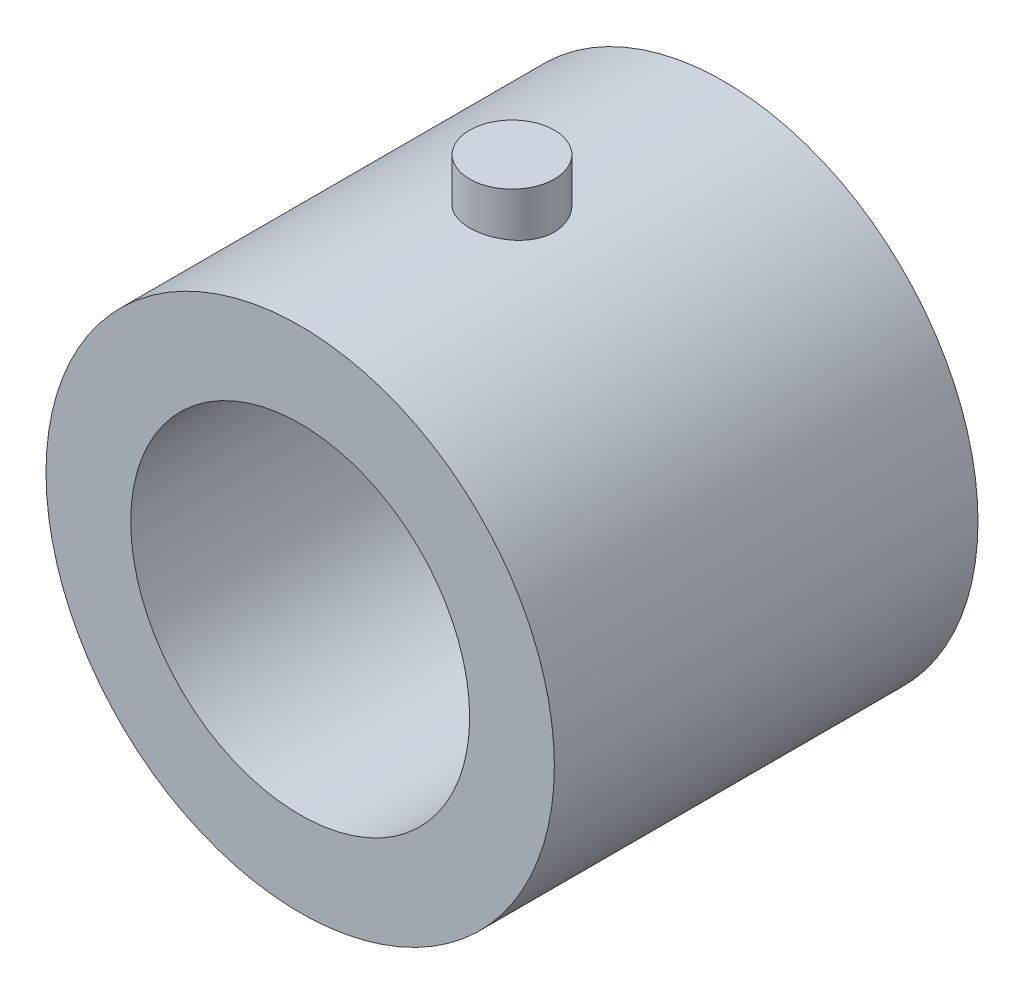
ISO-10303-21;
HEADER;
FILE_DESCRIPTION(('STEP AP214'),'2;1');
FILE_NAME('part.step','',(''),(''),'','','');
FILE_SCHEMA(('AUTOMOTIVE_DESIGN { 1 0 10303 214 1 1 1 1 }'));
ENDSEC;
DATA;
#1=APPLICATION_CONTEXT('core data for automotive mechanical design processes');
#2=APPLICATION_PROTOCOL_DEFINITION('international standard','automotive_design',2000,#1);
#3=PRODUCT_CONTEXT('',#1,'mechanical');
#4=PRODUCT('Part','Part','',(#3));
#5=PRODUCT_RELATED_PRODUCT_CATEGORY('part','',(#4));
#6=PRODUCT_DEFINITION_FORMATION('','',#4);
#7=PRODUCT_DEFINITION_CONTEXT('part definition',#1,'design');
#8=PRODUCT_DEFINITION('design','',#6,#7);
#9=PRODUCT_DEFINITION_SHAPE('','',#8);
#10=(LENGTH_UNIT() NAMED_UNIT(*) SI_UNIT(.MILLI.,.METRE.));
#11=(NAMED_UNIT(*) PLANE_ANGLE_UNIT() SI_UNIT($,.RADIAN.));
#12=(NAMED_UNIT(*) SI_UNIT($,.STERADIAN.) SOLID_ANGLE_UNIT());
#13=UNCERTAINTY_MEASURE_WITH_UNIT(LENGTH_MEASURE(1.E-05),#10,'distance_accuracy_value','');
#14=(GEOMETRIC_REPRESENTATION_CONTEXT(3) GLOBAL_UNCERTAINTY_ASSIGNED_CONTEXT((#13)) GLOBAL_UNIT_ASSIGNED_CONTEXT((#10,
#11,#12)) REPRESENTATION_CONTEXT('',''));
#15=CARTESIAN_POINT('',(0.,0.,0.));
#16=DIRECTION('',(0.,0.,1.));
#17=DIRECTION('',(1.,0.,0.));
#18=AXIS2_PLACEMENT_3D('',#15,#16,#17);
#19=CARTESIAN_POINT('',(0.,0.,5.));
#20=DIRECTION('',(0.,0.,-1.));
#21=DIRECTION('',(-1.,0.,0.));
#22=AXIS2_PLACEMENT_3D('',#19,#20,#21);
#23=CYLINDRICAL_SURFACE('',#22,3.);
#24=CARTESIAN_POINT('',(0.,0.,0.));
#25=DIRECTION('',(0.,0.,1.));
#26=DIRECTION('',(1.,0.,0.));
#27=AXIS2_PLACEMENT_3D('',#24,#25,#26);
#28=CIRCLE('',#27,3.);
#29=CARTESIAN_POINT('',(3.,0.,0.));
#30=VERTEX_POINT('',#29);
#31=EDGE_CURVE('E33',#30,#30,#28,.T.);
#32=ORIENTED_EDGE('',*,*,#31,.T.);
#33=EDGE_LOOP('',(#32));
#34=FACE_BOUND('',#33,.T.);
#35=CARTESIAN_POINT('',(0.,0.,5.));
#36=DIRECTION('',(0.,0.,1.));
#37=DIRECTION('',(1.,0.,0.));
#38=AXIS2_PLACEMENT_3D('',#35,#36,#37);
#39=CIRCLE('',#38,3.);
#40=CARTESIAN_POINT('',(3.,0.,5.));
#41=VERTEX_POINT('',#40);
#42=EDGE_CURVE('E37',#41,#41,#39,.T.);
#43=ORIENTED_EDGE('',*,*,#42,.F.);
#44=EDGE_LOOP('',(#43));
#45=FACE_BOUND('',#44,.T.);
#46=CARTESIAN_POINT('',(0.,3.,2.));
#47=CARTESIAN_POINT('',(-0.0278781809916429,2.99999952233765,2.00000111778956));
#48=CARTESIAN_POINT('',(-0.0557715763677641,2.99960735582607,2.00233945499378));
#49=CARTESIAN_POINT('',(-0.110776044334608,2.99808068988277,2.01162713175307));
#50=CARTESIAN_POINT('',(-0.137886373591849,2.99694550784778,2.01858071138232));
#51=CARTESIAN_POINT('',(-0.190520949442529,2.9940601364729,2.03688308971855));
#52=CARTESIAN_POINT('',(-0.21604647368638,2.99231045031839,2.04822829312812));
#53=CARTESIAN_POINT('',(-0.264828368395589,2.98838845416414,2.07498245841048));
#54=CARTESIAN_POINT('',(-0.288084997975718,2.98621619250887,2.0903909554966));
#55=CARTESIAN_POINT('',(-0.331894522858336,2.98166663491662,2.12499101676409));
#56=CARTESIAN_POINT('',(-0.352422580706993,2.97928774362971,2.14421382292723));
#57=CARTESIAN_POINT('',(-0.389977699731985,2.97460525375346,2.18582959369456));
#58=CARTESIAN_POINT('',(-0.407004539878194,2.97230165992533,2.20822275829132));
#59=CARTESIAN_POINT('',(-0.437173425121027,2.96801513151956,2.25571419323941));
#60=CARTESIAN_POINT('',(-0.4502909105722,2.96603425818327,2.28082826736095));
#61=CARTESIAN_POINT('',(-0.472111673082244,2.96263957958935,2.33294191286013));
#62=CARTESIAN_POINT('',(-0.480815248313123,2.96122573602861,2.35994135673553));
#63=CARTESIAN_POINT('',(-0.493482875556962,2.95914107368551,2.41479605497131));
#64=CARTESIAN_POINT('',(-0.49748980582708,2.9584635369714,2.44264114730028));
#65=CARTESIAN_POINT('',(-0.500783345057975,2.9579078778733,2.49861605537669));
#66=CARTESIAN_POINT('',(-0.500070288077799,2.95802969891443,2.52674585083346));
#67=CARTESIAN_POINT('',(-0.49397901967923,2.95905285772711,2.58218557225509));
#68=CARTESIAN_POINT('',(-0.488648976377955,2.95994614663783,2.60950096070905));
#69=CARTESIAN_POINT('',(-0.473550628080689,2.96239899042201,2.66284426356583));
#70=CARTESIAN_POINT('',(-0.463782170863948,2.96395856814654,2.68887213377771));
#71=CARTESIAN_POINT('',(-0.440035449218782,2.9675769586682,2.73904576468818));
#72=CARTESIAN_POINT('',(-0.426037182775943,2.96963813421465,2.76318188121625));
#73=CARTESIAN_POINT('',(-0.394242403511486,2.97402583683002,2.80878088010768));
#74=CARTESIAN_POINT('',(-0.376445584130857,2.97635238530857,2.83024354649099));
#75=CARTESIAN_POINT('',(-0.337296442431811,2.98104405575957,2.87016521716147));
#76=CARTESIAN_POINT('',(-0.315902792774625,2.9834092984633,2.88858370370802));
#77=CARTESIAN_POINT('',(-0.270307049796329,2.98788520279345,2.92157555253307));
#78=CARTESIAN_POINT('',(-0.246104938381284,2.98999586277949,2.93614889003665));
#79=CARTESIAN_POINT('',(-0.195541183233342,2.99372778578582,2.96104044542726));
#80=CARTESIAN_POINT('',(-0.169177745112932,2.99534863681489,2.97135508386625));
#81=CARTESIAN_POINT('',(-0.115059669120546,2.99791500602532,2.9873988430492));
#82=CARTESIAN_POINT('',(-0.0873051478358936,2.99886058070095,2.99312834739474));
#83=CARTESIAN_POINT('',(-0.0315419802603246,2.99996225968537,2.99978427169223));
#84=CARTESIAN_POINT('',(-0.00354014743020211,3.00012750602557,3.00076631436112));
#85=CARTESIAN_POINT('',(0.0522279545779776,2.99967494884234,2.99804773111438));
#86=CARTESIAN_POINT('',(0.0799942327784079,2.99905717544824,2.99434728537325));
#87=CARTESIAN_POINT('',(0.134331235109353,2.9971136538764,2.9824150301329));
#88=CARTESIAN_POINT('',(0.160908173677076,2.99579220960262,2.97421075832198));
#89=CARTESIAN_POINT('',(0.212309376972088,2.99258892891072,2.95353309636009));
#90=CARTESIAN_POINT('',(0.237133543181944,2.99070706102404,2.94105946647295));
#91=CARTESIAN_POINT('',(0.284566137893792,2.98656903260482,2.91206977506064));
#92=CARTESIAN_POINT('',(0.30715305018743,2.98430971177404,2.89551896876655));
#93=CARTESIAN_POINT('',(0.349248717100538,2.9796769347838,2.85889253692299));
#94=CARTESIAN_POINT('',(0.368757247939317,2.97730347034309,2.83881665534467));
#95=CARTESIAN_POINT('',(0.4043485559316,2.97268035047169,2.79546049038572));
#96=CARTESIAN_POINT('',(0.420393752222743,2.97043223227421,2.77214916689712));
#97=CARTESIAN_POINT('',(0.448340462058997,2.96634305955577,2.72312940617229));
#98=CARTESIAN_POINT('',(0.460242106953964,2.96450199213204,2.6974210449545));
#99=CARTESIAN_POINT('',(0.47950766629463,2.96144690739541,2.64444205343757));
#100=CARTESIAN_POINT('',(0.486890286509589,2.96023030862213,2.6171783809939));
#101=CARTESIAN_POINT('',(0.496967090755655,2.95855543367052,2.56177597415565));
#102=CARTESIAN_POINT('',(0.499661682389234,2.95809709156544,2.53363731605359));
#103=CARTESIAN_POINT('',(0.50027457320947,2.95799346616802,2.47765896680752));
#104=CARTESIAN_POINT('',(0.498252027225037,2.9583381130113,2.44981992428494));
#105=CARTESIAN_POINT('',(0.48961596779137,2.95977956290746,2.39488415038985));
#106=CARTESIAN_POINT('',(0.483002469222495,2.96087636352243,2.36778741661163));
#107=CARTESIAN_POINT('',(0.46539489791898,2.96369471256344,2.31512831254148));
#108=CARTESIAN_POINT('',(0.454405918120088,2.96541553443934,2.2895641979888));
#109=CARTESIAN_POINT('',(0.428365400783182,2.96928873784441,2.24063286616103));
#110=CARTESIAN_POINT('',(0.413313661749712,2.9714411407768,2.21726575792557));
#111=CARTESIAN_POINT('',(0.379363776874431,2.97596690809124,2.17309288337845));
#112=CARTESIAN_POINT('',(0.360422112718729,2.9783425911526,2.15232079665995));
#113=CARTESIAN_POINT('',(0.319321806276046,2.98302874472168,2.11422967910501));
#114=CARTESIAN_POINT('',(0.297162422582527,2.98533920005309,2.09691144627237));
#115=CARTESIAN_POINT('',(0.250073833928056,2.98965305928444,2.06611034636001));
#116=CARTESIAN_POINT('',(0.225126557506564,2.99165423250621,2.05265479213741));
#117=CARTESIAN_POINT('',(0.173302613875796,2.99510233520355,2.03014610307802));
#118=CARTESIAN_POINT('',(0.146427898966002,2.99654981635496,2.02108858378406));
#119=CARTESIAN_POINT('',(0.0995406620090799,2.99841158166591,2.00959894517467));
#120=CARTESIAN_POINT('',(0.0798117660596893,2.99900405454672,2.00600510607681));
#121=CARTESIAN_POINT('',(0.0400578620639618,2.99979843197224,2.00120525243105));
#122=CARTESIAN_POINT('',(0.0200328591216988,3.00000034324128,1.99999919677253));
#123=CARTESIAN_POINT('',(0.,3.,2.));
#124=B_SPLINE_CURVE_WITH_KNOTS('',3,(#46,#47,#48,#49,#50,#51,#52,#53,#54,#55,#56,#57,#58,#59,
#60,#61,#62,#63,#64,#65,#66,#67,#68,#69,#70,#71,#72,#73,#74,#75,#76,#77,#78,#79,#80,#81,#82,#83,
#84,#85,#86,#87,#88,#89,#90,#91,#92,#93,#94,#95,#96,#97,#98,#99,#100,#101,#102,#103,#104,#105,
#106,#107,#108,#109,#110,#111,#112,#113,#114,#115,#116,#117,#118,#119,#120,#121,#122,#123),
.UNSPECIFIED.,.T.,.F.,(4,2,2,2,2,2,2,2,2,2,2,2,2,2,2,2,2,2,2,2,2,2,2,2,2,2,2,2,2,2,2,2,2,2,2,2,
2,2,4),(0.,0.0835613169877019,0.167199509139084,0.250769373405054,0.334329682534958,
0.418604982124664,0.502885600339714,0.58768504164768,0.672478753752362,0.756492154206847,
0.840499608641773,0.923641043520817,1.00678533005076,1.09032911326512,1.17387964136115,
1.25846553982265,1.34305198327169,1.42770937783181,1.5123596890423,1.59601576698279,
1.67966862607172,1.76281561401283,1.84596727165213,1.92985365125405,2.01374612610857,
2.09850764401524,2.18326647475189,2.26767204468354,2.35207027557324,2.4354158190454,
2.51876109237627,2.60200963645245,2.68526231005867,2.76950276838678,2.85376266775795,
2.9386044632144,3.02336150426014,3.08340849632804,3.14345445455394),.UNSPECIFIED.);
#125=CARTESIAN_POINT('',(0.,3.,2.));
#126=VERTEX_POINT('',#125);
#127=EDGE_CURVE('E10',#126,#126,#124,.T.);
#128=ORIENTED_EDGE('',*,*,#127,.F.);
#129=EDGE_LOOP('',(#128));
#130=FACE_BOUND('',#129,.T.);
#131=ADVANCED_FACE('F29',(#34,#45,#130),#23,.T.);
#132=CARTESIAN_POINT('',(0.,0.,5.));
#133=DIRECTION('',(0.,0.,-1.));
#134=DIRECTION('',(-1.,0.,0.));
#135=AXIS2_PLACEMENT_3D('',#132,#133,#134);
#136=CYLINDRICAL_SURFACE('',#135,2.);
#137=CARTESIAN_POINT('',(0.,0.,5.));
#138=DIRECTION('',(0.,0.,1.));
#139=DIRECTION('',(1.,0.,0.));
#140=AXIS2_PLACEMENT_3D('',#137,#138,#139);
#141=CIRCLE('',#140,2.);
#142=CARTESIAN_POINT('',(2.,0.,5.));
#143=VERTEX_POINT('',#142);
#144=EDGE_CURVE('E48',#143,#143,#141,.T.);
#145=ORIENTED_EDGE('',*,*,#144,.T.);
#146=EDGE_LOOP('',(#145));
#147=FACE_BOUND('',#146,.T.);
#148=CARTESIAN_POINT('',(0.,0.,0.));
#149=DIRECTION('',(0.,0.,1.));
#150=DIRECTION('',(1.,0.,0.));
#151=AXIS2_PLACEMENT_3D('',#148,#149,#150);
#152=CIRCLE('',#151,2.);
#153=CARTESIAN_POINT('',(2.,0.,0.));
#154=VERTEX_POINT('',#153);
#155=EDGE_CURVE('E82',#154,#154,#152,.T.);
#156=ORIENTED_EDGE('',*,*,#155,.F.);
#157=EDGE_LOOP('',(#156));
#158=FACE_BOUND('',#157,.T.);
#159=ADVANCED_FACE('F58',(#147,#158),#136,.F.);
#160=CARTESIAN_POINT('',(0.,0.,5.));
#161=DIRECTION('',(0.,0.,1.));
#162=DIRECTION('',(1.,0.,0.));
#163=AXIS2_PLACEMENT_3D('',#160,#161,#162);
#164=PLANE('',#163);
#165=ORIENTED_EDGE('',*,*,#42,.T.);
#166=EDGE_LOOP('',(#165));
#167=FACE_BOUND('',#166,.T.);
#168=ORIENTED_EDGE('',*,*,#144,.F.);
#169=EDGE_LOOP('',(#168));
#170=FACE_BOUND('',#169,.T.);
#171=ADVANCED_FACE('F61',(#167,#170),#164,.T.);
#172=CARTESIAN_POINT('',(0.,0.,0.));
#173=DIRECTION('',(0.,0.,1.));
#174=DIRECTION('',(1.,0.,0.));
#175=AXIS2_PLACEMENT_3D('',#172,#173,#174);
#176=PLANE('',#175);
#177=ORIENTED_EDGE('',*,*,#31,.F.);
#178=EDGE_LOOP('',(#177));
#179=FACE_BOUND('',#178,.T.);
#180=ORIENTED_EDGE('',*,*,#155,.T.);
#181=EDGE_LOOP('',(#180));
#182=FACE_BOUND('',#181,.T.);
#183=ADVANCED_FACE('F56',(#179,#182),#176,.F.);
#184=CARTESIAN_POINT('',(0.,3.5,2.5));
#185=DIRECTION('',(0.,-1.,0.));
#186=DIRECTION('',(0.,0.,-1.));
#187=AXIS2_PLACEMENT_3D('',#184,#185,#186);
#188=CYLINDRICAL_SURFACE('',#187,0.5);
#189=CARTESIAN_POINT('',(0.,3.5,2.5));
#190=DIRECTION('',(0.,1.,0.));
#191=DIRECTION('',(0.,0.,1.));
#192=AXIS2_PLACEMENT_3D('',#189,#190,#191);
#193=CIRCLE('',#192,0.5);
#194=CARTESIAN_POINT('',(0.,3.5,3.));
#195=VERTEX_POINT('',#194);
#196=EDGE_CURVE('E47',#195,#195,#193,.T.);
#197=ORIENTED_EDGE('',*,*,#196,.F.);
#198=EDGE_LOOP('',(#197));
#199=FACE_BOUND('',#198,.T.);
#200=ORIENTED_EDGE('',*,*,#127,.T.);
#201=EDGE_LOOP('',(#200));
#202=FACE_BOUND('',#201,.T.);
#203=ADVANCED_FACE('F50',(#199,#202),#188,.T.);
#204=CARTESIAN_POINT('',(0.,3.5,2.5));
#205=DIRECTION('',(0.,1.,0.));
#206=DIRECTION('',(0.,0.,1.));
#207=AXIS2_PLACEMENT_3D('',#204,#205,#206);
#208=PLANE('',#207);
#209=ORIENTED_EDGE('',*,*,#196,.T.);
#210=EDGE_LOOP('',(#209));
#211=FACE_BOUND('',#210,.T.);
#212=ADVANCED_FACE('F55',(#211),#208,.T.);
#213=CLOSED_SHELL('',(#131,#159,#171,#183,#203,#212));
#214=MANIFOLD_SOLID_BREP('B2',#213);
#215=ADVANCED_BREP_SHAPE_REPRESENTATION('',(#18,#214),#14);
#216=SHAPE_DEFINITION_REPRESENTATION(#9,#215);
ENDSEC;
END-ISO-10303-21;
